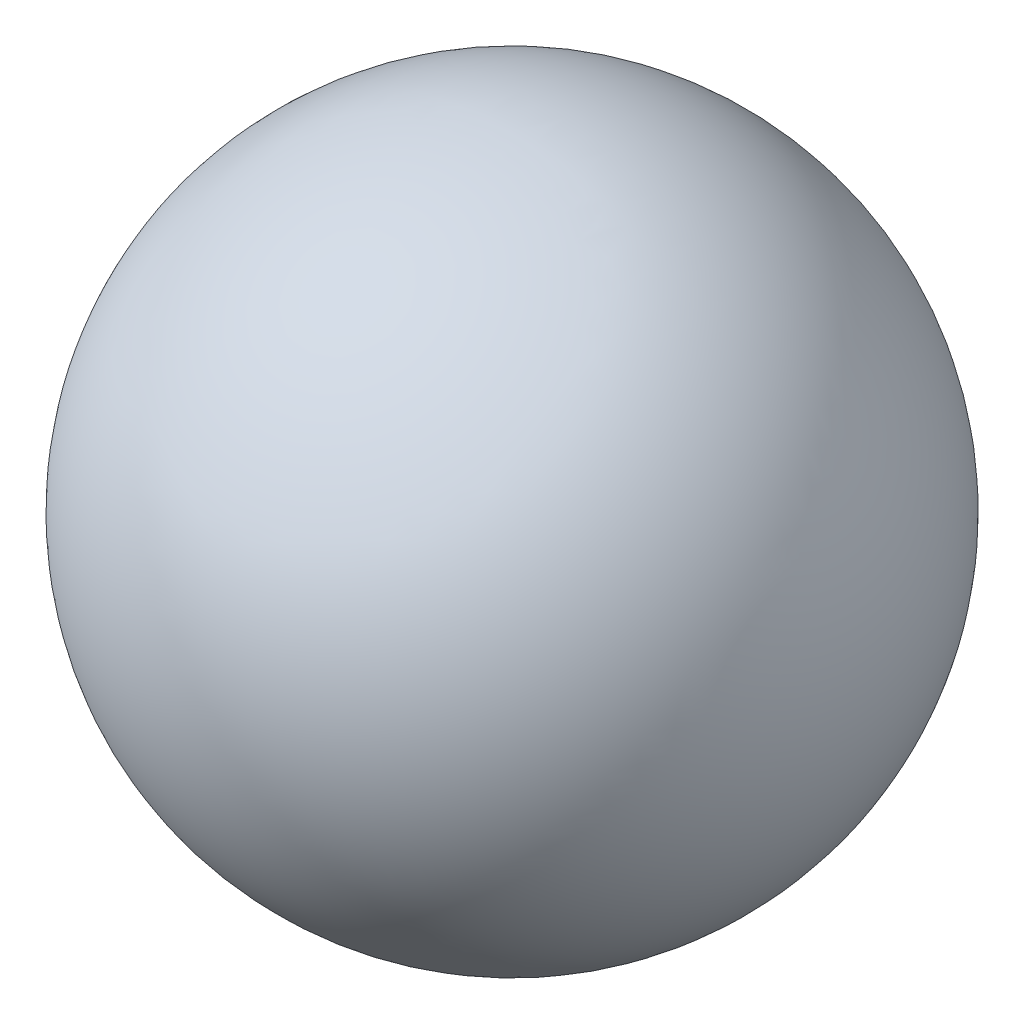
ISO-10303-21;
HEADER;
FILE_DESCRIPTION(('STEP AP214'),'2;1');
FILE_NAME('part.step','',(''),(''),'','','');
FILE_SCHEMA(('AUTOMOTIVE_DESIGN { 1 0 10303 214 1 1 1 1 }'));
ENDSEC;
DATA;
#1=APPLICATION_CONTEXT('core data for automotive mechanical design processes');
#2=APPLICATION_PROTOCOL_DEFINITION('international standard','automotive_design',2000,#1);
#3=PRODUCT_CONTEXT('',#1,'mechanical');
#4=PRODUCT('Part','Part','',(#3));
#5=PRODUCT_RELATED_PRODUCT_CATEGORY('part','',(#4));
#6=PRODUCT_DEFINITION_FORMATION('','',#4);
#7=PRODUCT_DEFINITION_CONTEXT('part definition',#1,'design');
#8=PRODUCT_DEFINITION('design','',#6,#7);
#9=PRODUCT_DEFINITION_SHAPE('','',#8);
#10=(LENGTH_UNIT() NAMED_UNIT(*) SI_UNIT(.MILLI.,.METRE.));
#11=(NAMED_UNIT(*) PLANE_ANGLE_UNIT() SI_UNIT($,.RADIAN.));
#12=(NAMED_UNIT(*) SI_UNIT($,.STERADIAN.) SOLID_ANGLE_UNIT());
#13=UNCERTAINTY_MEASURE_WITH_UNIT(LENGTH_MEASURE(1.E-05),#10,'distance_accuracy_value','');
#14=(GEOMETRIC_REPRESENTATION_CONTEXT(3) GLOBAL_UNCERTAINTY_ASSIGNED_CONTEXT((#13)) GLOBAL_UNIT_ASSIGNED_CONTEXT((#10,
#11,#12)) REPRESENTATION_CONTEXT('',''));
#15=CARTESIAN_POINT('',(0.,0.,0.));
#16=DIRECTION('',(0.,0.,1.));
#17=DIRECTION('',(1.,0.,0.));
#18=AXIS2_PLACEMENT_3D('',#15,#16,#17);
#19=CARTESIAN_POINT('',(6.06520907209298,8.34804411070648,0.));
#20=DIRECTION('',(1.,0.,0.));
#21=DIRECTION('',(0.,1.,0.));
#22=AXIS2_PLACEMENT_3D('',#19,#20,#21);
#23=SPHERICAL_SURFACE('',#22,1.71627890103155);
#24=CARTESIAN_POINT('',(7.78148797312453,8.34804411070648,0.));
#25=VERTEX_POINT('',#24);
#26=VERTEX_LOOP('',#25);
#27=FACE_BOUND('',#26,.T.);
#28=CARTESIAN_POINT('',(4.34893017106143,8.34804411070648,0.));
#29=VERTEX_POINT('',#28);
#30=VERTEX_LOOP('',#29);
#31=FACE_BOUND('',#30,.T.);
#32=ADVANCED_FACE('F16',(#27,#31),#23,.T.);
#33=CLOSED_SHELL('',(#32));
#34=MANIFOLD_SOLID_BREP('B1',#33);
#35=ADVANCED_BREP_SHAPE_REPRESENTATION('',(#18,#34),#14);
#36=SHAPE_DEFINITION_REPRESENTATION(#9,#35);
ENDSEC;
END-ISO-10303-21;
